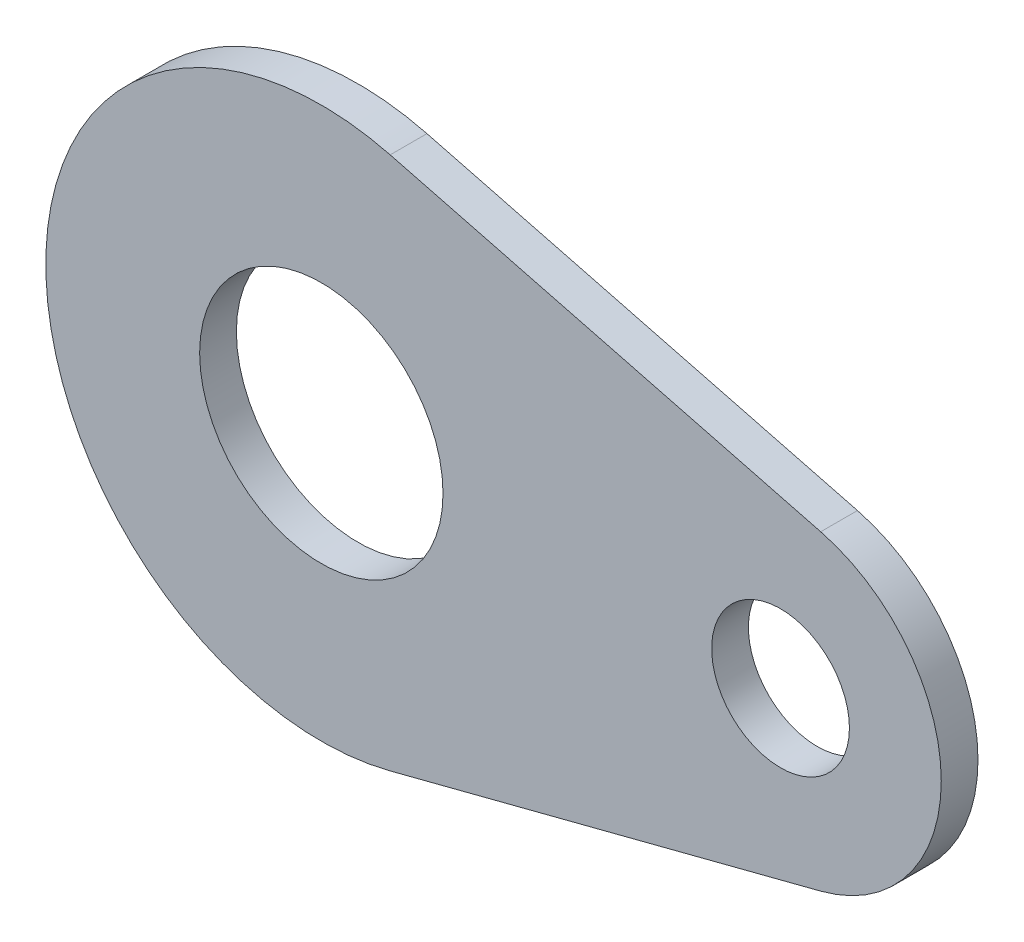
ISO-10303-21;
HEADER;
FILE_DESCRIPTION(('STEP AP214'),'2;1');
FILE_NAME('part.step','',(''),(''),'','','');
FILE_SCHEMA(('AUTOMOTIVE_DESIGN { 1 0 10303 214 1 1 1 1 }'));
ENDSEC;
DATA;
#1=APPLICATION_CONTEXT('core data for automotive mechanical design processes');
#2=APPLICATION_PROTOCOL_DEFINITION('international standard','automotive_design',2000,#1);
#3=PRODUCT_CONTEXT('',#1,'mechanical');
#4=PRODUCT('Part','Part','',(#3));
#5=PRODUCT_RELATED_PRODUCT_CATEGORY('part','',(#4));
#6=PRODUCT_DEFINITION_FORMATION('','',#4);
#7=PRODUCT_DEFINITION_CONTEXT('part definition',#1,'design');
#8=PRODUCT_DEFINITION('design','',#6,#7);
#9=PRODUCT_DEFINITION_SHAPE('','',#8);
#10=(LENGTH_UNIT() NAMED_UNIT(*) SI_UNIT(.MILLI.,.METRE.));
#11=(NAMED_UNIT(*) PLANE_ANGLE_UNIT() SI_UNIT($,.RADIAN.));
#12=(NAMED_UNIT(*) SI_UNIT($,.STERADIAN.) SOLID_ANGLE_UNIT());
#13=UNCERTAINTY_MEASURE_WITH_UNIT(LENGTH_MEASURE(1.E-05),#10,'distance_accuracy_value','');
#14=(GEOMETRIC_REPRESENTATION_CONTEXT(3) GLOBAL_UNCERTAINTY_ASSIGNED_CONTEXT((#13)) GLOBAL_UNIT_ASSIGNED_CONTEXT((#10,
#11,#12)) REPRESENTATION_CONTEXT('',''));
#15=CARTESIAN_POINT('',(0.,0.,0.));
#16=DIRECTION('',(0.,0.,1.));
#17=DIRECTION('',(1.,0.,0.));
#18=AXIS2_PLACEMENT_3D('',#15,#16,#17);
#19=CARTESIAN_POINT('',(0.,0.,0.8));
#20=DIRECTION('',(0.,0.,1.));
#21=DIRECTION('',(1.,0.,0.));
#22=AXIS2_PLACEMENT_3D('',#19,#20,#21);
#23=PLANE('',#22);
#24=CARTESIAN_POINT('',(0.,0.,0.8));
#25=DIRECTION('',(0.,0.,1.));
#26=DIRECTION('',(1.,0.,0.));
#27=AXIS2_PLACEMENT_3D('',#24,#25,#26);
#28=CIRCLE('',#27,2.65);
#29=CARTESIAN_POINT('',(2.65,0.,0.8));
#30=VERTEX_POINT('',#29);
#31=EDGE_CURVE('E101',#30,#30,#28,.T.);
#32=ORIENTED_EDGE('',*,*,#31,.F.);
#33=EDGE_LOOP('',(#32));
#34=FACE_BOUND('',#33,.T.);
#35=CARTESIAN_POINT('',(0.,0.,0.8));
#36=DIRECTION('',(0.,0.,1.));
#37=DIRECTION('',(1.,0.,0.));
#38=AXIS2_PLACEMENT_3D('',#35,#36,#37);
#39=CIRCLE('',#38,6.);
#40=CARTESIAN_POINT('',(1.5,5.80947501931113,0.8));
#41=VERTEX_POINT('',#40);
#42=CARTESIAN_POINT('',(1.5,-5.80947501931113,0.8));
#43=VERTEX_POINT('',#42);
#44=EDGE_CURVE('E86',#41,#43,#39,.T.);
#45=ORIENTED_EDGE('',*,*,#44,.T.);
#46=DIRECTION('',(0.968245836551854,0.25,0.));
#47=VECTOR('',#46,1.);
#48=CARTESIAN_POINT('',(10.875,-3.38886042793149,0.8));
#49=LINE('',#48,#47);
#50=CARTESIAN_POINT('',(10.875,-3.38886042793149,0.8));
#51=VERTEX_POINT('',#50);
#52=EDGE_CURVE('E81',#43,#51,#49,.T.);
#53=ORIENTED_EDGE('',*,*,#52,.T.);
#54=CARTESIAN_POINT('',(10.,0.,0.8));
#55=DIRECTION('',(0.,0.,1.));
#56=DIRECTION('',(-1.,0.,0.));
#57=AXIS2_PLACEMENT_3D('',#54,#55,#56);
#58=CIRCLE('',#57,3.5);
#59=CARTESIAN_POINT('',(10.875,3.38886042793149,0.8));
#60=VERTEX_POINT('',#59);
#61=EDGE_CURVE('E84',#51,#60,#58,.T.);
#62=ORIENTED_EDGE('',*,*,#61,.T.);
#63=DIRECTION('',(-0.968245836551854,0.25,0.));
#64=VECTOR('',#63,1.);
#65=CARTESIAN_POINT('',(1.5,5.80947501931113,0.8));
#66=LINE('',#65,#64);
#67=EDGE_CURVE('E51',#60,#41,#66,.T.);
#68=ORIENTED_EDGE('',*,*,#67,.T.);
#69=EDGE_LOOP('',(#45,#53,#62,#68));
#70=FACE_BOUND('',#69,.T.);
#71=CARTESIAN_POINT('',(10.,0.,0.8));
#72=DIRECTION('',(0.,0.,1.));
#73=DIRECTION('',(1.,0.,0.));
#74=AXIS2_PLACEMENT_3D('',#71,#72,#73);
#75=CIRCLE('',#74,1.5);
#76=CARTESIAN_POINT('',(11.5,0.,0.8));
#77=VERTEX_POINT('',#76);
#78=EDGE_CURVE('E116',#77,#77,#75,.T.);
#79=ORIENTED_EDGE('',*,*,#78,.F.);
#80=EDGE_LOOP('',(#79));
#81=FACE_BOUND('',#80,.T.);
#82=ADVANCED_FACE('F34',(#34,#70,#81),#23,.T.);
#83=CARTESIAN_POINT('',(0.,0.,0.));
#84=DIRECTION('',(0.,0.,1.));
#85=DIRECTION('',(1.,0.,0.));
#86=AXIS2_PLACEMENT_3D('',#83,#84,#85);
#87=PLANE('',#86);
#88=CARTESIAN_POINT('',(0.,0.,0.));
#89=DIRECTION('',(0.,0.,1.));
#90=DIRECTION('',(1.,0.,0.));
#91=AXIS2_PLACEMENT_3D('',#88,#89,#90);
#92=CIRCLE('',#91,6.);
#93=CARTESIAN_POINT('',(1.5,5.80947501931113,0.));
#94=VERTEX_POINT('',#93);
#95=CARTESIAN_POINT('',(1.5,-5.80947501931113,0.));
#96=VERTEX_POINT('',#95);
#97=EDGE_CURVE('E98',#94,#96,#92,.T.);
#98=ORIENTED_EDGE('',*,*,#97,.F.);
#99=DIRECTION('',(-0.968245836551854,0.25,0.));
#100=VECTOR('',#99,1.);
#101=CARTESIAN_POINT('',(1.5,5.80947501931113,0.));
#102=LINE('',#101,#100);
#103=CARTESIAN_POINT('',(10.875,3.38886042793149,0.));
#104=VERTEX_POINT('',#103);
#105=EDGE_CURVE('E74',#104,#94,#102,.T.);
#106=ORIENTED_EDGE('',*,*,#105,.F.);
#107=CARTESIAN_POINT('',(10.,0.,0.));
#108=DIRECTION('',(0.,0.,1.));
#109=DIRECTION('',(-1.,0.,0.));
#110=AXIS2_PLACEMENT_3D('',#107,#108,#109);
#111=CIRCLE('',#110,3.5);
#112=CARTESIAN_POINT('',(10.875,-3.38886042793149,0.));
#113=VERTEX_POINT('',#112);
#114=EDGE_CURVE('E68',#113,#104,#111,.T.);
#115=ORIENTED_EDGE('',*,*,#114,.F.);
#116=DIRECTION('',(0.968245836551854,0.25,0.));
#117=VECTOR('',#116,1.);
#118=CARTESIAN_POINT('',(10.875,-3.38886042793149,0.));
#119=LINE('',#118,#117);
#120=EDGE_CURVE('E90',#96,#113,#119,.T.);
#121=ORIENTED_EDGE('',*,*,#120,.F.);
#122=EDGE_LOOP('',(#98,#106,#115,#121));
#123=FACE_BOUND('',#122,.T.);
#124=CARTESIAN_POINT('',(0.,0.,0.));
#125=DIRECTION('',(0.,0.,1.));
#126=DIRECTION('',(1.,0.,0.));
#127=AXIS2_PLACEMENT_3D('',#124,#125,#126);
#128=CIRCLE('',#127,2.65);
#129=CARTESIAN_POINT('',(2.65,0.,0.));
#130=VERTEX_POINT('',#129);
#131=EDGE_CURVE('E113',#130,#130,#128,.T.);
#132=ORIENTED_EDGE('',*,*,#131,.T.);
#133=EDGE_LOOP('',(#132));
#134=FACE_BOUND('',#133,.T.);
#135=CARTESIAN_POINT('',(10.,0.,0.));
#136=DIRECTION('',(0.,0.,1.));
#137=DIRECTION('',(1.,0.,0.));
#138=AXIS2_PLACEMENT_3D('',#135,#136,#137);
#139=CIRCLE('',#138,1.5);
#140=CARTESIAN_POINT('',(11.5,0.,0.));
#141=VERTEX_POINT('',#140);
#142=EDGE_CURVE('E119',#141,#141,#139,.T.);
#143=ORIENTED_EDGE('',*,*,#142,.T.);
#144=EDGE_LOOP('',(#143));
#145=FACE_BOUND('',#144,.T.);
#146=ADVANCED_FACE('F109',(#123,#134,#145),#87,.F.);
#147=CARTESIAN_POINT('',(0.,0.,0.8));
#148=DIRECTION('',(0.,0.,-1.));
#149=DIRECTION('',(-1.,0.,0.));
#150=AXIS2_PLACEMENT_3D('',#147,#148,#149);
#151=CYLINDRICAL_SURFACE('',#150,6.);
#152=ORIENTED_EDGE('',*,*,#97,.T.);
#153=DIRECTION('',(0.,0.,-1.));
#154=VECTOR('',#153,1.);
#155=CARTESIAN_POINT('',(1.5,-5.80947501931113,0.8));
#156=LINE('',#155,#154);
#157=EDGE_CURVE('E11',#43,#96,#156,.T.);
#158=ORIENTED_EDGE('',*,*,#157,.F.);
#159=ORIENTED_EDGE('',*,*,#44,.F.);
#160=DIRECTION('',(0.,0.,-1.));
#161=VECTOR('',#160,1.);
#162=CARTESIAN_POINT('',(1.5,5.80947501931113,0.8));
#163=LINE('',#162,#161);
#164=EDGE_CURVE('E94',#41,#94,#163,.T.);
#165=ORIENTED_EDGE('',*,*,#164,.T.);
#166=EDGE_LOOP('',(#152,#158,#159,#165));
#167=FACE_BOUND('',#166,.T.);
#168=ADVANCED_FACE('F36',(#167),#151,.T.);
#169=CARTESIAN_POINT('',(10.875,-3.38886042793149,0.8));
#170=DIRECTION('',(-0.25,0.968245836551854,0.));
#171=DIRECTION('',(-0.968245836551854,-0.25,0.));
#172=AXIS2_PLACEMENT_3D('',#169,#170,#171);
#173=PLANE('',#172);
#174=ORIENTED_EDGE('',*,*,#120,.T.);
#175=DIRECTION('',(0.,0.,-1.));
#176=VECTOR('',#175,1.);
#177=CARTESIAN_POINT('',(10.875,-3.38886042793149,0.8));
#178=LINE('',#177,#176);
#179=EDGE_CURVE('E43',#51,#113,#178,.T.);
#180=ORIENTED_EDGE('',*,*,#179,.F.);
#181=ORIENTED_EDGE('',*,*,#52,.F.);
#182=ORIENTED_EDGE('',*,*,#157,.T.);
#183=EDGE_LOOP('',(#174,#180,#181,#182));
#184=FACE_BOUND('',#183,.T.);
#185=ADVANCED_FACE('F89',(#184),#173,.F.);
#186=CARTESIAN_POINT('',(10.,0.,0.8));
#187=DIRECTION('',(0.,0.,-1.));
#188=DIRECTION('',(-1.,0.,0.));
#189=AXIS2_PLACEMENT_3D('',#186,#187,#188);
#190=CYLINDRICAL_SURFACE('',#189,3.5);
#191=ORIENTED_EDGE('',*,*,#114,.T.);
#192=DIRECTION('',(0.,0.,-1.));
#193=VECTOR('',#192,1.);
#194=CARTESIAN_POINT('',(10.875,3.38886042793149,0.8));
#195=LINE('',#194,#193);
#196=EDGE_CURVE('E91',#60,#104,#195,.T.);
#197=ORIENTED_EDGE('',*,*,#196,.F.);
#198=ORIENTED_EDGE('',*,*,#61,.F.);
#199=ORIENTED_EDGE('',*,*,#179,.T.);
#200=EDGE_LOOP('',(#191,#197,#198,#199));
#201=FACE_BOUND('',#200,.T.);
#202=ADVANCED_FACE('F92',(#201),#190,.T.);
#203=CARTESIAN_POINT('',(1.5,5.80947501931113,0.8));
#204=DIRECTION('',(-0.25,-0.968245836551854,0.));
#205=DIRECTION('',(0.968245836551854,-0.25,0.));
#206=AXIS2_PLACEMENT_3D('',#203,#204,#205);
#207=PLANE('',#206);
#208=ORIENTED_EDGE('',*,*,#105,.T.);
#209=ORIENTED_EDGE('',*,*,#164,.F.);
#210=ORIENTED_EDGE('',*,*,#67,.F.);
#211=ORIENTED_EDGE('',*,*,#196,.T.);
#212=EDGE_LOOP('',(#208,#209,#210,#211));
#213=FACE_BOUND('',#212,.T.);
#214=ADVANCED_FACE('F106',(#213),#207,.F.);
#215=CARTESIAN_POINT('',(0.,0.,0.8));
#216=DIRECTION('',(0.,0.,-1.));
#217=DIRECTION('',(-1.,0.,0.));
#218=AXIS2_PLACEMENT_3D('',#215,#216,#217);
#219=CYLINDRICAL_SURFACE('',#218,2.65);
#220=ORIENTED_EDGE('',*,*,#31,.T.);
#221=EDGE_LOOP('',(#220));
#222=FACE_BOUND('',#221,.T.);
#223=ORIENTED_EDGE('',*,*,#131,.F.);
#224=EDGE_LOOP('',(#223));
#225=FACE_BOUND('',#224,.T.);
#226=ADVANCED_FACE('F136',(#222,#225),#219,.F.);
#227=CARTESIAN_POINT('',(10.,0.,0.8));
#228=DIRECTION('',(0.,0.,-1.));
#229=DIRECTION('',(-1.,0.,0.));
#230=AXIS2_PLACEMENT_3D('',#227,#228,#229);
#231=CYLINDRICAL_SURFACE('',#230,1.5);
#232=ORIENTED_EDGE('',*,*,#78,.T.);
#233=EDGE_LOOP('',(#232));
#234=FACE_BOUND('',#233,.T.);
#235=ORIENTED_EDGE('',*,*,#142,.F.);
#236=EDGE_LOOP('',(#235));
#237=FACE_BOUND('',#236,.T.);
#238=ADVANCED_FACE('F125',(#234,#237),#231,.F.);
#239=CLOSED_SHELL('',(#82,#146,#168,#185,#202,#214,#226,#238));
#240=MANIFOLD_SOLID_BREP('B2',#239);
#241=ADVANCED_BREP_SHAPE_REPRESENTATION('',(#18,#240),#14);
#242=SHAPE_DEFINITION_REPRESENTATION(#9,#241);
ENDSEC;
END-ISO-10303-21;
